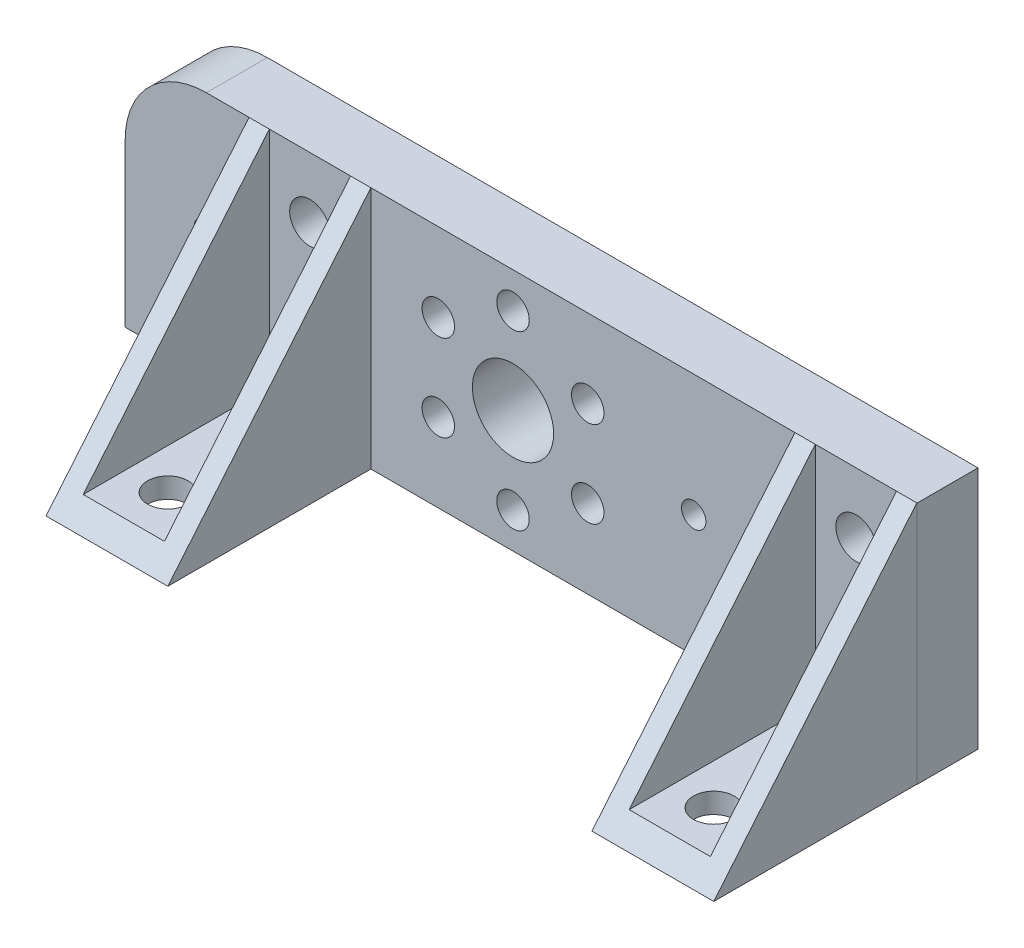
ISO-10303-21;
HEADER;
FILE_DESCRIPTION(('STEP AP214'),'2;1');
FILE_NAME('part.step','',(''),(''),'','','');
FILE_SCHEMA(('AUTOMOTIVE_DESIGN { 1 0 10303 214 1 1 1 1 }'));
ENDSEC;
DATA;
#1=APPLICATION_CONTEXT('core data for automotive mechanical design processes');
#2=APPLICATION_PROTOCOL_DEFINITION('international standard','automotive_design',2000,#1);
#3=PRODUCT_CONTEXT('',#1,'mechanical');
#4=PRODUCT('Part','Part','',(#3));
#5=PRODUCT_RELATED_PRODUCT_CATEGORY('part','',(#4));
#6=PRODUCT_DEFINITION_FORMATION('','',#4);
#7=PRODUCT_DEFINITION_CONTEXT('part definition',#1,'design');
#8=PRODUCT_DEFINITION('design','',#6,#7);
#9=PRODUCT_DEFINITION_SHAPE('','',#8);
#10=(LENGTH_UNIT() NAMED_UNIT(*) SI_UNIT(.MILLI.,.METRE.));
#11=(NAMED_UNIT(*) PLANE_ANGLE_UNIT() SI_UNIT($,.RADIAN.));
#12=(NAMED_UNIT(*) SI_UNIT($,.STERADIAN.) SOLID_ANGLE_UNIT());
#13=UNCERTAINTY_MEASURE_WITH_UNIT(LENGTH_MEASURE(1.E-05),#10,'distance_accuracy_value','');
#14=(GEOMETRIC_REPRESENTATION_CONTEXT(3) GLOBAL_UNCERTAINTY_ASSIGNED_CONTEXT((#13)) GLOBAL_UNIT_ASSIGNED_CONTEXT((#10,
#11,#12)) REPRESENTATION_CONTEXT('',''));
#15=CARTESIAN_POINT('',(0.,0.,0.));
#16=DIRECTION('',(0.,0.,1.));
#17=DIRECTION('',(1.,0.,0.));
#18=AXIS2_PLACEMENT_3D('',#15,#16,#17);
#19=CARTESIAN_POINT('',(0.,0.,3.));
#20=DIRECTION('',(0.,0.,1.));
#21=DIRECTION('',(1.,0.,0.));
#22=AXIS2_PLACEMENT_3D('',#19,#20,#21);
#23=PLANE('',#22);
#24=CARTESIAN_POINT('',(12.9,3.,3.));
#25=DIRECTION('',(0.,0.,1.));
#26=DIRECTION('',(1.,0.,0.));
#27=AXIS2_PLACEMENT_3D('',#24,#25,#26);
#28=CIRCLE('',#27,1.);
#29=CARTESIAN_POINT('',(13.9,3.,3.));
#30=VERTEX_POINT('',#29);
#31=EDGE_CURVE('E393',#30,#30,#28,.T.);
#32=ORIENTED_EDGE('',*,*,#31,.F.);
#33=EDGE_LOOP('',(#32));
#34=FACE_BOUND('',#33,.T.);
#35=CARTESIAN_POINT('',(12.9,-3.,3.));
#36=DIRECTION('',(0.,0.,1.));
#37=DIRECTION('',(1.,0.,0.));
#38=AXIS2_PLACEMENT_3D('',#35,#36,#37);
#39=CIRCLE('',#38,1.);
#40=CARTESIAN_POINT('',(13.9,-3.,3.));
#41=VERTEX_POINT('',#40);
#42=EDGE_CURVE('E390',#41,#41,#39,.T.);
#43=ORIENTED_EDGE('',*,*,#42,.F.);
#44=EDGE_LOOP('',(#43));
#45=FACE_BOUND('',#44,.T.);
#46=DIRECTION('',(1.,0.,0.));
#47=VECTOR('',#46,1.);
#48=CARTESIAN_POINT('',(26.8867571858841,-4.99999999999999,3.));
#49=LINE('',#48,#47);
#50=CARTESIAN_POINT('',(10.8867571858841,-5.,3.));
#51=VERTEX_POINT('',#50);
#52=CARTESIAN_POINT('',(14.8867571858841,-5.,3.));
#53=VERTEX_POINT('',#52);
#54=EDGE_CURVE('E435',#51,#53,#49,.T.);
#55=ORIENTED_EDGE('',*,*,#54,.T.);
#56=DIRECTION('',(0.,-1.,0.));
#57=VECTOR('',#56,1.);
#58=CARTESIAN_POINT('',(14.8867571858841,0.,3.));
#59=LINE('',#58,#57);
#60=CARTESIAN_POINT('',(14.8867571858841,6.,3.));
#61=VERTEX_POINT('',#60);
#62=EDGE_CURVE('E431',#61,#53,#59,.T.);
#63=ORIENTED_EDGE('',*,*,#62,.F.);
#64=DIRECTION('',(1.,0.,0.));
#65=VECTOR('',#64,1.);
#66=CARTESIAN_POINT('',(0.,6.,3.));
#67=LINE('',#66,#65);
#68=CARTESIAN_POINT('',(10.8867571858841,6.,3.));
#69=VERTEX_POINT('',#68);
#70=EDGE_CURVE('E196',#69,#61,#67,.T.);
#71=ORIENTED_EDGE('',*,*,#70,.F.);
#72=DIRECTION('',(0.,-1.,0.));
#73=VECTOR('',#72,1.);
#74=CARTESIAN_POINT('',(10.8867571858841,0.,3.));
#75=LINE('',#74,#73);
#76=EDGE_CURVE('E188',#69,#51,#75,.T.);
#77=ORIENTED_EDGE('',*,*,#76,.T.);
#78=EDGE_LOOP('',(#55,#63,#71,#77));
#79=FACE_BOUND('',#78,.T.);
#80=ADVANCED_FACE('F35',(#34,#45,#79),#23,.T.);
#81=CARTESIAN_POINT('',(15.8867571858841,6.,3.));
#82=VERTEX_POINT('',#81);
#83=CARTESIAN_POINT('',(15.9,6.,3.));
#84=VERTEX_POINT('',#83);
#85=EDGE_CURVE('E199',#82,#84,#67,.T.);
#86=ORIENTED_EDGE('',*,*,#85,.F.);
#87=DIRECTION('',(0.,1.,0.));
#88=VECTOR('',#87,1.);
#89=CARTESIAN_POINT('',(15.8867571858841,0.,3.));
#90=LINE('',#89,#88);
#91=CARTESIAN_POINT('',(15.8867571858841,-6.,3.));
#92=VERTEX_POINT('',#91);
#93=EDGE_CURVE('E187',#92,#82,#90,.T.);
#94=ORIENTED_EDGE('',*,*,#93,.F.);
#95=DIRECTION('',(1.,0.,0.));
#96=VECTOR('',#95,1.);
#97=CARTESIAN_POINT('',(0.,-6.,3.));
#98=LINE('',#97,#96);
#99=CARTESIAN_POINT('',(15.9,-6.,3.));
#100=VERTEX_POINT('',#99);
#101=EDGE_CURVE('E284',#92,#100,#98,.T.);
#102=ORIENTED_EDGE('',*,*,#101,.T.);
#103=DIRECTION('',(0.,1.,0.));
#104=VECTOR('',#103,1.);
#105=CARTESIAN_POINT('',(15.9,0.,3.));
#106=LINE('',#105,#104);
#107=EDGE_CURVE('E204',#100,#84,#106,.T.);
#108=ORIENTED_EDGE('',*,*,#107,.T.);
#109=EDGE_LOOP('',(#86,#94,#102,#108));
#110=FACE_BOUND('',#109,.T.);
#111=ADVANCED_FACE('F290',(#110),#23,.T.);
#112=CARTESIAN_POINT('',(-19.1,0.,3.));
#113=DIRECTION('',(0.,0.,1.));
#114=DIRECTION('',(1.,0.,0.));
#115=AXIS2_PLACEMENT_3D('',#112,#113,#114);
#116=CIRCLE('',#115,0.6);
#117=CARTESIAN_POINT('',(-18.5,0.,3.));
#118=VERTEX_POINT('',#117);
#119=EDGE_CURVE('E396',#118,#118,#116,.T.);
#120=ORIENTED_EDGE('',*,*,#119,.F.);
#121=EDGE_LOOP('',(#120));
#122=FACE_BOUND('',#121,.T.);
#123=CARTESIAN_POINT('',(-23.1,-6.,3.));
#124=VERTEX_POINT('',#123);
#125=CARTESIAN_POINT('',(-17.,-6.,3.));
#126=VERTEX_POINT('',#125);
#127=EDGE_CURVE('E261',#124,#126,#98,.T.);
#128=ORIENTED_EDGE('',*,*,#127,.T.);
#129=DIRECTION('',(0.,1.,0.));
#130=VECTOR('',#129,1.);
#131=CARTESIAN_POINT('',(-17.,0.,3.));
#132=LINE('',#131,#130);
#133=CARTESIAN_POINT('',(-17.,6.,3.));
#134=VERTEX_POINT('',#133);
#135=EDGE_CURVE('E340',#126,#134,#132,.T.);
#136=ORIENTED_EDGE('',*,*,#135,.T.);
#137=CARTESIAN_POINT('',(-19.1,6.,3.));
#138=VERTEX_POINT('',#137);
#139=EDGE_CURVE('E198',#138,#134,#67,.T.);
#140=ORIENTED_EDGE('',*,*,#139,.F.);
#141=CARTESIAN_POINT('',(-19.1,2.,3.));
#142=DIRECTION('',(0.,0.,1.));
#143=DIRECTION('',(1.,0.,0.));
#144=AXIS2_PLACEMENT_3D('',#141,#142,#143);
#145=CIRCLE('',#144,4.);
#146=CARTESIAN_POINT('',(-23.1,2.,3.));
#147=VERTEX_POINT('',#146);
#148=EDGE_CURVE('E286',#147,#138,#145,.F.);
#149=ORIENTED_EDGE('',*,*,#148,.F.);
#150=DIRECTION('',(0.,1.,0.));
#151=VECTOR('',#150,1.);
#152=CARTESIAN_POINT('',(-23.1,0.,3.));
#153=LINE('',#152,#151);
#154=EDGE_CURVE('E271',#124,#147,#153,.T.);
#155=ORIENTED_EDGE('',*,*,#154,.F.);
#156=EDGE_LOOP('',(#128,#136,#140,#149,#155));
#157=FACE_BOUND('',#156,.T.);
#158=ADVANCED_FACE('F400',(#122,#157),#23,.T.);
#159=CARTESIAN_POINT('',(-14.,-3.,3.));
#160=DIRECTION('',(0.,0.,1.));
#161=DIRECTION('',(1.,0.,0.));
#162=AXIS2_PLACEMENT_3D('',#159,#160,#161);
#163=CIRCLE('',#162,1.);
#164=CARTESIAN_POINT('',(-13.,-3.,3.));
#165=VERTEX_POINT('',#164);
#166=EDGE_CURVE('E387',#165,#165,#163,.T.);
#167=ORIENTED_EDGE('',*,*,#166,.F.);
#168=EDGE_LOOP('',(#167));
#169=FACE_BOUND('',#168,.T.);
#170=CARTESIAN_POINT('',(-14.,3.,3.));
#171=DIRECTION('',(0.,0.,1.));
#172=DIRECTION('',(1.,0.,0.));
#173=AXIS2_PLACEMENT_3D('',#170,#171,#172);
#174=CIRCLE('',#173,1.);
#175=CARTESIAN_POINT('',(-13.,3.,3.));
#176=VERTEX_POINT('',#175);
#177=EDGE_CURVE('E249',#176,#176,#174,.T.);
#178=ORIENTED_EDGE('',*,*,#177,.F.);
#179=EDGE_LOOP('',(#178));
#180=FACE_BOUND('',#179,.T.);
#181=CARTESIAN_POINT('',(-16.,6.,3.));
#182=VERTEX_POINT('',#181);
#183=CARTESIAN_POINT('',(-12.,6.,3.));
#184=VERTEX_POINT('',#183);
#185=EDGE_CURVE('E195',#182,#184,#67,.T.);
#186=ORIENTED_EDGE('',*,*,#185,.F.);
#187=DIRECTION('',(0.,-1.,0.));
#188=VECTOR('',#187,1.);
#189=CARTESIAN_POINT('',(-16.,0.,3.));
#190=LINE('',#189,#188);
#191=CARTESIAN_POINT('',(-16.,-5.,3.));
#192=VERTEX_POINT('',#191);
#193=EDGE_CURVE('E338',#182,#192,#190,.T.);
#194=ORIENTED_EDGE('',*,*,#193,.T.);
#195=DIRECTION('',(1.,0.,0.));
#196=VECTOR('',#195,1.);
#197=CARTESIAN_POINT('',(0.,-4.99999999999999,3.));
#198=LINE('',#197,#196);
#199=CARTESIAN_POINT('',(-12.,-5.,3.));
#200=VERTEX_POINT('',#199);
#201=EDGE_CURVE('E335',#192,#200,#198,.T.);
#202=ORIENTED_EDGE('',*,*,#201,.T.);
#203=DIRECTION('',(0.,-1.,0.));
#204=VECTOR('',#203,1.);
#205=CARTESIAN_POINT('',(-12.,0.,3.));
#206=LINE('',#205,#204);
#207=EDGE_CURVE('E328',#184,#200,#206,.T.);
#208=ORIENTED_EDGE('',*,*,#207,.F.);
#209=EDGE_LOOP('',(#186,#194,#202,#208));
#210=FACE_BOUND('',#209,.T.);
#211=ADVANCED_FACE('F408',(#169,#180,#210),#23,.T.);
#212=CARTESIAN_POINT('',(-19.1,2.,3.));
#213=DIRECTION('',(0.,0.,-1.));
#214=DIRECTION('',(-1.,0.,0.));
#215=AXIS2_PLACEMENT_3D('',#212,#213,#214);
#216=CYLINDRICAL_SURFACE('',#215,4.);
#217=CARTESIAN_POINT('',(-19.1,2.,0.));
#218=DIRECTION('',(0.,0.,1.));
#219=DIRECTION('',(1.,0.,0.));
#220=AXIS2_PLACEMENT_3D('',#217,#218,#219);
#221=CIRCLE('',#220,4.);
#222=CARTESIAN_POINT('',(-23.1,2.,0.));
#223=VERTEX_POINT('',#222);
#224=CARTESIAN_POINT('',(-19.1,6.,0.));
#225=VERTEX_POINT('',#224);
#226=EDGE_CURVE('E228',#223,#225,#221,.F.);
#227=ORIENTED_EDGE('',*,*,#226,.F.);
#228=DIRECTION('',(0.,0.,-1.));
#229=VECTOR('',#228,1.);
#230=CARTESIAN_POINT('',(-23.1,2.,3.));
#231=LINE('',#230,#229);
#232=EDGE_CURVE('E11',#147,#223,#231,.T.);
#233=ORIENTED_EDGE('',*,*,#232,.F.);
#234=ORIENTED_EDGE('',*,*,#148,.T.);
#235=DIRECTION('',(0.,0.,-1.));
#236=VECTOR('',#235,1.);
#237=CARTESIAN_POINT('',(-19.1,6.,3.));
#238=LINE('',#237,#236);
#239=EDGE_CURVE('E211',#138,#225,#238,.T.);
#240=ORIENTED_EDGE('',*,*,#239,.T.);
#241=EDGE_LOOP('',(#227,#233,#234,#240));
#242=FACE_BOUND('',#241,.T.);
#243=ADVANCED_FACE('F275',(#242),#216,.T.);
#244=CARTESIAN_POINT('',(-23.1,0.,3.));
#245=DIRECTION('',(-1.,0.,0.));
#246=DIRECTION('',(0.,0.,1.));
#247=AXIS2_PLACEMENT_3D('',#244,#245,#246);
#248=PLANE('',#247);
#249=DIRECTION('',(0.,1.,0.));
#250=VECTOR('',#249,1.);
#251=CARTESIAN_POINT('',(-23.1,0.,0.));
#252=LINE('',#251,#250);
#253=CARTESIAN_POINT('',(-23.1,-6.,0.));
#254=VERTEX_POINT('',#253);
#255=EDGE_CURVE('E231',#254,#223,#252,.T.);
#256=ORIENTED_EDGE('',*,*,#255,.F.);
#257=DIRECTION('',(0.,0.,-1.));
#258=VECTOR('',#257,1.);
#259=CARTESIAN_POINT('',(-23.1,-6.,3.));
#260=LINE('',#259,#258);
#261=EDGE_CURVE('E43',#124,#254,#260,.T.);
#262=ORIENTED_EDGE('',*,*,#261,.F.);
#263=ORIENTED_EDGE('',*,*,#154,.T.);
#264=ORIENTED_EDGE('',*,*,#232,.T.);
#265=EDGE_LOOP('',(#256,#262,#263,#264));
#266=FACE_BOUND('',#265,.T.);
#267=ADVANCED_FACE('F269',(#266),#248,.T.);
#268=CARTESIAN_POINT('',(0.,-6.,3.));
#269=DIRECTION('',(0.,1.,0.));
#270=DIRECTION('',(0.,0.,1.));
#271=AXIS2_PLACEMENT_3D('',#268,#269,#270);
#272=PLANE('',#271);
#273=CARTESIAN_POINT('',(12.8867571858841,-6.,5.));
#274=DIRECTION('',(0.,1.,0.));
#275=DIRECTION('',(0.,0.,1.));
#276=AXIS2_PLACEMENT_3D('',#273,#274,#275);
#277=CIRCLE('',#276,1.);
#278=CARTESIAN_POINT('',(12.8867571858841,-6.,6.));
#279=VERTEX_POINT('',#278);
#280=EDGE_CURVE('E177',#279,#279,#277,.T.);
#281=ORIENTED_EDGE('',*,*,#280,.T.);
#282=EDGE_LOOP('',(#281));
#283=FACE_BOUND('',#282,.T.);
#284=CARTESIAN_POINT('',(12.8867571858841,-6.,10.));
#285=DIRECTION('',(0.,1.,0.));
#286=DIRECTION('',(0.,0.,1.));
#287=AXIS2_PLACEMENT_3D('',#284,#285,#286);
#288=CIRCLE('',#287,1.);
#289=CARTESIAN_POINT('',(12.8867571858841,-6.,11.));
#290=VERTEX_POINT('',#289);
#291=EDGE_CURVE('E790',#290,#290,#288,.T.);
#292=ORIENTED_EDGE('',*,*,#291,.T.);
#293=EDGE_LOOP('',(#292));
#294=FACE_BOUND('',#293,.T.);
#295=CARTESIAN_POINT('',(-14.,-6.,5.));
#296=DIRECTION('',(0.,1.,0.));
#297=DIRECTION('',(0.,0.,1.));
#298=AXIS2_PLACEMENT_3D('',#295,#296,#297);
#299=CIRCLE('',#298,1.);
#300=CARTESIAN_POINT('',(-14.,-6.,6.));
#301=VERTEX_POINT('',#300);
#302=EDGE_CURVE('E311',#301,#301,#299,.T.);
#303=ORIENTED_EDGE('',*,*,#302,.T.);
#304=EDGE_LOOP('',(#303));
#305=FACE_BOUND('',#304,.T.);
#306=CARTESIAN_POINT('',(-14.,-6.,10.));
#307=DIRECTION('',(0.,1.,0.));
#308=DIRECTION('',(0.,0.,1.));
#309=AXIS2_PLACEMENT_3D('',#306,#307,#308);
#310=CIRCLE('',#309,1.);
#311=CARTESIAN_POINT('',(-14.,-6.,11.));
#312=VERTEX_POINT('',#311);
#313=EDGE_CURVE('E306',#312,#312,#310,.T.);
#314=ORIENTED_EDGE('',*,*,#313,.T.);
#315=EDGE_LOOP('',(#314));
#316=FACE_BOUND('',#315,.T.);
#317=DIRECTION('',(1.,0.,0.));
#318=VECTOR('',#317,1.);
#319=CARTESIAN_POINT('',(0.,-6.,0.));
#320=LINE('',#319,#318);
#321=CARTESIAN_POINT('',(15.9,-6.,0.));
#322=VERTEX_POINT('',#321);
#323=EDGE_CURVE('E234',#254,#322,#320,.T.);
#324=ORIENTED_EDGE('',*,*,#323,.T.);
#325=DIRECTION('',(0.,0.,-1.));
#326=VECTOR('',#325,1.);
#327=CARTESIAN_POINT('',(15.9,-6.,3.));
#328=LINE('',#327,#326);
#329=EDGE_CURVE('E253',#100,#322,#328,.T.);
#330=ORIENTED_EDGE('',*,*,#329,.F.);
#331=ORIENTED_EDGE('',*,*,#101,.F.);
#332=DIRECTION('',(0.,0.,-1.));
#333=VECTOR('',#332,1.);
#334=CARTESIAN_POINT('',(15.8867571858841,-6.,13.));
#335=LINE('',#334,#333);
#336=CARTESIAN_POINT('',(15.8867571858841,-6.,13.));
#337=VERTEX_POINT('',#336);
#338=EDGE_CURVE('E50',#337,#92,#335,.T.);
#339=ORIENTED_EDGE('',*,*,#338,.F.);
#340=DIRECTION('',(1.,0.,0.));
#341=VECTOR('',#340,1.);
#342=CARTESIAN_POINT('',(26.8867571858841,-6.,13.));
#343=LINE('',#342,#341);
#344=CARTESIAN_POINT('',(9.88675718588411,-6.,13.));
#345=VERTEX_POINT('',#344);
#346=EDGE_CURVE('E291',#345,#337,#343,.T.);
#347=ORIENTED_EDGE('',*,*,#346,.F.);
#348=DIRECTION('',(0.,0.,-1.));
#349=VECTOR('',#348,1.);
#350=CARTESIAN_POINT('',(9.88675718588411,-6.,13.));
#351=LINE('',#350,#349);
#352=CARTESIAN_POINT('',(9.88675718588411,-6.,3.));
#353=VERTEX_POINT('',#352);
#354=EDGE_CURVE('E175',#345,#353,#351,.T.);
#355=ORIENTED_EDGE('',*,*,#354,.T.);
#356=CARTESIAN_POINT('',(-11.,-6.,3.));
#357=VERTEX_POINT('',#356);
#358=EDGE_CURVE('E186',#357,#353,#98,.T.);
#359=ORIENTED_EDGE('',*,*,#358,.F.);
#360=DIRECTION('',(0.,0.,-1.));
#361=VECTOR('',#360,1.);
#362=CARTESIAN_POINT('',(-11.,-6.,13.));
#363=LINE('',#362,#361);
#364=CARTESIAN_POINT('',(-11.,-6.,13.));
#365=VERTEX_POINT('',#364);
#366=EDGE_CURVE('E331',#365,#357,#363,.T.);
#367=ORIENTED_EDGE('',*,*,#366,.F.);
#368=DIRECTION('',(1.,0.,0.));
#369=VECTOR('',#368,1.);
#370=CARTESIAN_POINT('',(0.,-6.,13.));
#371=LINE('',#370,#369);
#372=CARTESIAN_POINT('',(-17.,-6.,13.));
#373=VERTEX_POINT('',#372);
#374=EDGE_CURVE('E329',#373,#365,#371,.T.);
#375=ORIENTED_EDGE('',*,*,#374,.F.);
#376=DIRECTION('',(0.,0.,-1.));
#377=VECTOR('',#376,1.);
#378=CARTESIAN_POINT('',(-17.,-6.,13.));
#379=LINE('',#378,#377);
#380=EDGE_CURVE('E345',#373,#126,#379,.T.);
#381=ORIENTED_EDGE('',*,*,#380,.T.);
#382=ORIENTED_EDGE('',*,*,#127,.F.);
#383=ORIENTED_EDGE('',*,*,#261,.T.);
#384=EDGE_LOOP('',(#324,#330,#331,#339,#347,#355,#359,#367,#375,#381,#382,#383));
#385=FACE_BOUND('',#384,.T.);
#386=ADVANCED_FACE('F258',(#283,#294,#305,#316,#385),#272,.F.);
#387=CARTESIAN_POINT('',(15.9,0.,3.));
#388=DIRECTION('',(-1.,0.,0.));
#389=DIRECTION('',(0.,-1.,0.));
#390=AXIS2_PLACEMENT_3D('',#387,#388,#389);
#391=PLANE('',#390);
#392=DIRECTION('',(0.,1.,0.));
#393=VECTOR('',#392,1.);
#394=CARTESIAN_POINT('',(15.9,0.,0.));
#395=LINE('',#394,#393);
#396=CARTESIAN_POINT('',(15.9,6.,0.));
#397=VERTEX_POINT('',#396);
#398=EDGE_CURVE('E237',#322,#397,#395,.T.);
#399=ORIENTED_EDGE('',*,*,#398,.T.);
#400=DIRECTION('',(0.,0.,-1.));
#401=VECTOR('',#400,1.);
#402=CARTESIAN_POINT('',(15.9,6.,3.));
#403=LINE('',#402,#401);
#404=EDGE_CURVE('E251',#84,#397,#403,.T.);
#405=ORIENTED_EDGE('',*,*,#404,.F.);
#406=ORIENTED_EDGE('',*,*,#107,.F.);
#407=ORIENTED_EDGE('',*,*,#329,.T.);
#408=EDGE_LOOP('',(#399,#405,#406,#407));
#409=FACE_BOUND('',#408,.T.);
#410=ADVANCED_FACE('F282',(#409),#391,.F.);
#411=CARTESIAN_POINT('',(4.9,0.,3.));
#412=DIRECTION('',(0.,0.,-1.));
#413=DIRECTION('',(-1.,0.,0.));
#414=AXIS2_PLACEMENT_3D('',#411,#412,#413);
#415=CYLINDRICAL_SURFACE('',#414,0.6);
#416=CARTESIAN_POINT('',(4.9,0.,3.));
#417=DIRECTION('',(0.,0.,1.));
#418=DIRECTION('',(1.,0.,0.));
#419=AXIS2_PLACEMENT_3D('',#416,#417,#418);
#420=CIRCLE('',#419,0.6);
#421=CARTESIAN_POINT('',(5.5,0.,3.));
#422=VERTEX_POINT('',#421);
#423=EDGE_CURVE('E203',#422,#422,#420,.T.);
#424=ORIENTED_EDGE('',*,*,#423,.T.);
#425=EDGE_LOOP('',(#424));
#426=FACE_BOUND('',#425,.T.);
#427=CARTESIAN_POINT('',(4.9,0.,0.));
#428=DIRECTION('',(0.,0.,1.));
#429=DIRECTION('',(1.,0.,0.));
#430=AXIS2_PLACEMENT_3D('',#427,#428,#429);
#431=CIRCLE('',#430,0.6);
#432=CARTESIAN_POINT('',(5.5,0.,0.));
#433=VERTEX_POINT('',#432);
#434=EDGE_CURVE('E243',#433,#433,#431,.T.);
#435=ORIENTED_EDGE('',*,*,#434,.F.);
#436=EDGE_LOOP('',(#435));
#437=FACE_BOUND('',#436,.T.);
#438=ADVANCED_FACE('F521',(#426,#437),#415,.F.);
#439=CARTESIAN_POINT('',(0.,6.,3.));
#440=DIRECTION('',(0.,1.,0.));
#441=DIRECTION('',(0.,0.,1.));
#442=AXIS2_PLACEMENT_3D('',#439,#440,#441);
#443=PLANE('',#442);
#444=DIRECTION('',(-1.,0.,0.));
#445=VECTOR('',#444,1.);
#446=CARTESIAN_POINT('',(54.8867571858841,6.,3.));
#447=LINE('',#446,#445);
#448=EDGE_CURVE('E167',#82,#61,#447,.T.);
#449=ORIENTED_EDGE('',*,*,#448,.F.);
#450=ORIENTED_EDGE('',*,*,#85,.T.);
#451=ORIENTED_EDGE('',*,*,#404,.T.);
#452=DIRECTION('',(1.,0.,0.));
#453=VECTOR('',#452,1.);
#454=CARTESIAN_POINT('',(0.,6.,0.));
#455=LINE('',#454,#453);
#456=EDGE_CURVE('E240',#225,#397,#455,.T.);
#457=ORIENTED_EDGE('',*,*,#456,.F.);
#458=ORIENTED_EDGE('',*,*,#239,.F.);
#459=ORIENTED_EDGE('',*,*,#139,.T.);
#460=DIRECTION('',(-1.,0.,0.));
#461=VECTOR('',#460,1.);
#462=CARTESIAN_POINT('',(28.,6.,3.));
#463=LINE('',#462,#461);
#464=EDGE_CURVE('E316',#182,#134,#463,.T.);
#465=ORIENTED_EDGE('',*,*,#464,.F.);
#466=ORIENTED_EDGE('',*,*,#185,.T.);
#467=CARTESIAN_POINT('',(-11.,6.,3.));
#468=VERTEX_POINT('',#467);
#469=EDGE_CURVE('E194',#468,#184,#463,.T.);
#470=ORIENTED_EDGE('',*,*,#469,.F.);
#471=CARTESIAN_POINT('',(9.88675718588411,6.,3.));
#472=VERTEX_POINT('',#471);
#473=EDGE_CURVE('E183',#468,#472,#67,.T.);
#474=ORIENTED_EDGE('',*,*,#473,.T.);
#475=EDGE_CURVE('E156',#69,#472,#447,.T.);
#476=ORIENTED_EDGE('',*,*,#475,.F.);
#477=ORIENTED_EDGE('',*,*,#70,.T.);
#478=EDGE_LOOP('',(#449,#450,#451,#457,#458,#459,#465,#466,#470,#474,#476,#477));
#479=FACE_BOUND('',#478,.T.);
#480=ADVANCED_FACE('F192',(#479),#443,.T.);
#481=CARTESIAN_POINT('',(-19.1,0.,3.));
#482=DIRECTION('',(0.,0.,-1.));
#483=DIRECTION('',(-1.,0.,0.));
#484=AXIS2_PLACEMENT_3D('',#481,#482,#483);
#485=CYLINDRICAL_SURFACE('',#484,0.6);
#486=ORIENTED_EDGE('',*,*,#119,.T.);
#487=EDGE_LOOP('',(#486));
#488=FACE_BOUND('',#487,.T.);
#489=CARTESIAN_POINT('',(-19.1,0.,0.));
#490=DIRECTION('',(0.,0.,1.));
#491=DIRECTION('',(1.,0.,0.));
#492=AXIS2_PLACEMENT_3D('',#489,#490,#491);
#493=CIRCLE('',#492,0.6);
#494=CARTESIAN_POINT('',(-18.5,0.,0.));
#495=VERTEX_POINT('',#494);
#496=EDGE_CURVE('E225',#495,#495,#493,.T.);
#497=ORIENTED_EDGE('',*,*,#496,.F.);
#498=EDGE_LOOP('',(#497));
#499=FACE_BOUND('',#498,.T.);
#500=ADVANCED_FACE('F509',(#488,#499),#485,.F.);
#501=CARTESIAN_POINT('',(12.9,3.,3.));
#502=DIRECTION('',(0.,0.,-1.));
#503=DIRECTION('',(-1.,0.,0.));
#504=AXIS2_PLACEMENT_3D('',#501,#502,#503);
#505=CYLINDRICAL_SURFACE('',#504,1.);
#506=ORIENTED_EDGE('',*,*,#31,.T.);
#507=EDGE_LOOP('',(#506));
#508=FACE_BOUND('',#507,.T.);
#509=CARTESIAN_POINT('',(12.9,3.,0.));
#510=DIRECTION('',(0.,0.,1.));
#511=DIRECTION('',(1.,0.,0.));
#512=AXIS2_PLACEMENT_3D('',#509,#510,#511);
#513=CIRCLE('',#512,1.);
#514=CARTESIAN_POINT('',(13.9,3.,0.));
#515=VERTEX_POINT('',#514);
#516=EDGE_CURVE('E222',#515,#515,#513,.T.);
#517=ORIENTED_EDGE('',*,*,#516,.F.);
#518=EDGE_LOOP('',(#517));
#519=FACE_BOUND('',#518,.T.);
#520=ADVANCED_FACE('F511',(#508,#519),#505,.F.);
#521=CARTESIAN_POINT('',(12.9,-3.,3.));
#522=DIRECTION('',(0.,0.,-1.));
#523=DIRECTION('',(-1.,0.,0.));
#524=AXIS2_PLACEMENT_3D('',#521,#522,#523);
#525=CYLINDRICAL_SURFACE('',#524,1.);
#526=ORIENTED_EDGE('',*,*,#42,.T.);
#527=EDGE_LOOP('',(#526));
#528=FACE_BOUND('',#527,.T.);
#529=CARTESIAN_POINT('',(12.9,-3.,0.));
#530=DIRECTION('',(0.,0.,1.));
#531=DIRECTION('',(1.,0.,0.));
#532=AXIS2_PLACEMENT_3D('',#529,#530,#531);
#533=CIRCLE('',#532,1.);
#534=CARTESIAN_POINT('',(13.9,-3.,0.));
#535=VERTEX_POINT('',#534);
#536=EDGE_CURVE('E219',#535,#535,#533,.T.);
#537=ORIENTED_EDGE('',*,*,#536,.F.);
#538=EDGE_LOOP('',(#537));
#539=FACE_BOUND('',#538,.T.);
#540=ADVANCED_FACE('F518',(#528,#539),#525,.F.);
#541=CARTESIAN_POINT('',(-14.,-3.,3.));
#542=DIRECTION('',(0.,0.,-1.));
#543=DIRECTION('',(-1.,0.,0.));
#544=AXIS2_PLACEMENT_3D('',#541,#542,#543);
#545=CYLINDRICAL_SURFACE('',#544,1.);
#546=ORIENTED_EDGE('',*,*,#166,.T.);
#547=EDGE_LOOP('',(#546));
#548=FACE_BOUND('',#547,.T.);
#549=CARTESIAN_POINT('',(-14.,-3.,0.));
#550=DIRECTION('',(0.,0.,1.));
#551=DIRECTION('',(1.,0.,0.));
#552=AXIS2_PLACEMENT_3D('',#549,#550,#551);
#553=CIRCLE('',#552,1.);
#554=CARTESIAN_POINT('',(-13.,-3.,0.));
#555=VERTEX_POINT('',#554);
#556=EDGE_CURVE('E215',#555,#555,#553,.T.);
#557=ORIENTED_EDGE('',*,*,#556,.F.);
#558=EDGE_LOOP('',(#557));
#559=FACE_BOUND('',#558,.T.);
#560=ADVANCED_FACE('F497',(#548,#559),#545,.F.);
#561=CARTESIAN_POINT('',(-14.,3.,3.));
#562=DIRECTION('',(0.,0.,-1.));
#563=DIRECTION('',(-1.,0.,0.));
#564=AXIS2_PLACEMENT_3D('',#561,#562,#563);
#565=CYLINDRICAL_SURFACE('',#564,1.);
#566=ORIENTED_EDGE('',*,*,#177,.T.);
#567=EDGE_LOOP('',(#566));
#568=FACE_BOUND('',#567,.T.);
#569=CARTESIAN_POINT('',(-14.,3.,0.));
#570=DIRECTION('',(0.,0.,1.));
#571=DIRECTION('',(1.,0.,0.));
#572=AXIS2_PLACEMENT_3D('',#569,#570,#571);
#573=CIRCLE('',#572,1.);
#574=CARTESIAN_POINT('',(-13.,3.,0.));
#575=VERTEX_POINT('',#574);
#576=EDGE_CURVE('E212',#575,#575,#573,.T.);
#577=ORIENTED_EDGE('',*,*,#576,.F.);
#578=EDGE_LOOP('',(#577));
#579=FACE_BOUND('',#578,.T.);
#580=ADVANCED_FACE('F37',(#568,#579),#565,.F.);
#581=CARTESIAN_POINT('',(-4.,0.,3.));
#582=DIRECTION('',(0.,0.,-1.));
#583=DIRECTION('',(-1.,0.,0.));
#584=AXIS2_PLACEMENT_3D('',#581,#582,#583);
#585=CYLINDRICAL_SURFACE('',#584,2.);
#586=CARTESIAN_POINT('',(-4.,0.,3.));
#587=DIRECTION('',(0.,0.,1.));
#588=DIRECTION('',(1.,0.,0.));
#589=AXIS2_PLACEMENT_3D('',#586,#587,#588);
#590=CIRCLE('',#589,2.);
#591=CARTESIAN_POINT('',(-2.,0.,3.));
#592=VERTEX_POINT('',#591);
#593=EDGE_CURVE('E208',#592,#592,#590,.T.);
#594=ORIENTED_EDGE('',*,*,#593,.T.);
#595=EDGE_LOOP('',(#594));
#596=FACE_BOUND('',#595,.T.);
#597=CARTESIAN_POINT('',(-4.,0.,0.));
#598=DIRECTION('',(0.,0.,1.));
#599=DIRECTION('',(1.,0.,0.));
#600=AXIS2_PLACEMENT_3D('',#597,#598,#599);
#601=CIRCLE('',#600,2.);
#602=CARTESIAN_POINT('',(-2.,0.,0.));
#603=VERTEX_POINT('',#602);
#604=EDGE_CURVE('E246',#603,#603,#601,.T.);
#605=ORIENTED_EDGE('',*,*,#604,.F.);
#606=EDGE_LOOP('',(#605));
#607=FACE_BOUND('',#606,.T.);
#608=ADVANCED_FACE('F474',(#596,#607),#585,.F.);
#609=DIRECTION('',(0.,1.,0.));
#610=VECTOR('',#609,1.);
#611=CARTESIAN_POINT('',(9.88675718588411,0.,3.));
#612=LINE('',#611,#610);
#613=EDGE_CURVE('E173',#353,#472,#612,.T.);
#614=ORIENTED_EDGE('',*,*,#613,.T.);
#615=ORIENTED_EDGE('',*,*,#473,.F.);
#616=DIRECTION('',(0.,1.,0.));
#617=VECTOR('',#616,1.);
#618=CARTESIAN_POINT('',(-11.,0.,3.));
#619=LINE('',#618,#617);
#620=EDGE_CURVE('E332',#357,#468,#619,.T.);
#621=ORIENTED_EDGE('',*,*,#620,.F.);
#622=ORIENTED_EDGE('',*,*,#358,.T.);
#623=EDGE_LOOP('',(#614,#615,#621,#622));
#624=FACE_BOUND('',#623,.T.);
#625=CARTESIAN_POINT('',(-0.31939203391616,2.12500000000004,3.));
#626=DIRECTION('',(0.,0.,1.));
#627=DIRECTION('',(0.50000000000001,-0.866025403784433,0.));
#628=AXIS2_PLACEMENT_3D('',#625,#626,#627);
#629=CIRCLE('',#628,0.8);
#630=CARTESIAN_POINT('',(0.0806079660838479,1.4321796769725,3.));
#631=VERTEX_POINT('',#630);
#632=EDGE_CURVE('E350',#631,#631,#629,.T.);
#633=ORIENTED_EDGE('',*,*,#632,.F.);
#634=EDGE_LOOP('',(#633));
#635=FACE_BOUND('',#634,.T.);
#636=CARTESIAN_POINT('',(-0.319392033916116,-2.12499999999997,3.));
#637=DIRECTION('',(0.,0.,1.));
#638=DIRECTION('',(-0.499999999999992,-0.866025403784443,0.));
#639=AXIS2_PLACEMENT_3D('',#636,#637,#638);
#640=CIRCLE('',#639,0.8);
#641=CARTESIAN_POINT('',(-0.719392033916109,-2.81782032302752,3.));
#642=VERTEX_POINT('',#641);
#643=EDGE_CURVE('E367',#642,#642,#640,.T.);
#644=ORIENTED_EDGE('',*,*,#643,.F.);
#645=EDGE_LOOP('',(#644));
#646=FACE_BOUND('',#645,.T.);
#647=CARTESIAN_POINT('',(-4.,-4.25,3.));
#648=DIRECTION('',(0.,0.,1.));
#649=DIRECTION('',(-1.,0.,0.));
#650=AXIS2_PLACEMENT_3D('',#647,#648,#649);
#651=CIRCLE('',#650,0.8);
#652=CARTESIAN_POINT('',(-4.8,-4.25,3.));
#653=VERTEX_POINT('',#652);
#654=EDGE_CURVE('E361',#653,#653,#651,.T.);
#655=ORIENTED_EDGE('',*,*,#654,.F.);
#656=EDGE_LOOP('',(#655));
#657=FACE_BOUND('',#656,.T.);
#658=CARTESIAN_POINT('',(-7.68060796608386,-2.12500000000002,3.));
#659=DIRECTION('',(0.,0.,1.));
#660=DIRECTION('',(-0.500000000000004,0.866025403784436,0.));
#661=AXIS2_PLACEMENT_3D('',#658,#659,#660);
#662=CIRCLE('',#661,0.8);
#663=CARTESIAN_POINT('',(-8.08060796608386,-1.43217967697247,3.));
#664=VERTEX_POINT('',#663);
#665=EDGE_CURVE('E355',#664,#664,#662,.T.);
#666=ORIENTED_EDGE('',*,*,#665,.F.);
#667=EDGE_LOOP('',(#666));
#668=FACE_BOUND('',#667,.T.);
#669=CARTESIAN_POINT('',(-7.68060796608387,2.12499999999999,3.));
#670=DIRECTION('',(0.,0.,1.));
#671=DIRECTION('',(0.499999999999998,0.86602540378444,0.));
#672=AXIS2_PLACEMENT_3D('',#669,#670,#671);
#673=CIRCLE('',#672,0.8);
#674=CARTESIAN_POINT('',(-7.28060796608387,2.81782032302754,3.));
#675=VERTEX_POINT('',#674);
#676=EDGE_CURVE('E354',#675,#675,#673,.T.);
#677=ORIENTED_EDGE('',*,*,#676,.F.);
#678=EDGE_LOOP('',(#677));
#679=FACE_BOUND('',#678,.T.);
#680=CARTESIAN_POINT('',(-4.,4.25,3.));
#681=DIRECTION('',(0.,0.,1.));
#682=DIRECTION('',(1.,0.,0.));
#683=AXIS2_PLACEMENT_3D('',#680,#681,#682);
#684=CIRCLE('',#683,0.8);
#685=CARTESIAN_POINT('',(-3.2,4.25,3.));
#686=VERTEX_POINT('',#685);
#687=EDGE_CURVE('E378',#686,#686,#684,.T.);
#688=ORIENTED_EDGE('',*,*,#687,.F.);
#689=EDGE_LOOP('',(#688));
#690=FACE_BOUND('',#689,.T.);
#691=ORIENTED_EDGE('',*,*,#423,.F.);
#692=EDGE_LOOP('',(#691));
#693=FACE_BOUND('',#692,.T.);
#694=ORIENTED_EDGE('',*,*,#593,.F.);
#695=EDGE_LOOP('',(#694));
#696=FACE_BOUND('',#695,.T.);
#697=ADVANCED_FACE('F181',(#624,#635,#646,#657,#668,#679,#690,#693,#696),#23,.T.);
#698=CARTESIAN_POINT('',(0.,0.,0.));
#699=DIRECTION('',(0.,0.,1.));
#700=DIRECTION('',(1.,0.,0.));
#701=AXIS2_PLACEMENT_3D('',#698,#699,#700);
#702=PLANE('',#701);
#703=CARTESIAN_POINT('',(-0.31939203391616,2.12500000000004,0.));
#704=DIRECTION('',(0.,0.,1.));
#705=DIRECTION('',(0.50000000000001,-0.866025403784433,0.));
#706=AXIS2_PLACEMENT_3D('',#703,#704,#705);
#707=CIRCLE('',#706,0.8);
#708=CARTESIAN_POINT('',(0.0806079660838479,1.4321796769725,0.));
#709=VERTEX_POINT('',#708);
#710=EDGE_CURVE('E370',#709,#709,#707,.T.);
#711=ORIENTED_EDGE('',*,*,#710,.T.);
#712=EDGE_LOOP('',(#711));
#713=FACE_BOUND('',#712,.T.);
#714=CARTESIAN_POINT('',(-0.319392033916116,-2.12499999999997,0.));
#715=DIRECTION('',(0.,0.,1.));
#716=DIRECTION('',(-0.499999999999992,-0.866025403784443,0.));
#717=AXIS2_PLACEMENT_3D('',#714,#715,#716);
#718=CIRCLE('',#717,0.8);
#719=CARTESIAN_POINT('',(-0.719392033916109,-2.81782032302752,0.));
#720=VERTEX_POINT('',#719);
#721=EDGE_CURVE('E364',#720,#720,#718,.T.);
#722=ORIENTED_EDGE('',*,*,#721,.T.);
#723=EDGE_LOOP('',(#722));
#724=FACE_BOUND('',#723,.T.);
#725=CARTESIAN_POINT('',(-4.,-4.25,0.));
#726=DIRECTION('',(0.,0.,1.));
#727=DIRECTION('',(-1.,0.,0.));
#728=AXIS2_PLACEMENT_3D('',#725,#726,#727);
#729=CIRCLE('',#728,0.8);
#730=CARTESIAN_POINT('',(-4.8,-4.25,0.));
#731=VERTEX_POINT('',#730);
#732=EDGE_CURVE('E358',#731,#731,#729,.T.);
#733=ORIENTED_EDGE('',*,*,#732,.T.);
#734=EDGE_LOOP('',(#733));
#735=FACE_BOUND('',#734,.T.);
#736=CARTESIAN_POINT('',(-7.68060796608386,-2.12500000000002,0.));
#737=DIRECTION('',(0.,0.,1.));
#738=DIRECTION('',(-0.500000000000004,0.866025403784436,0.));
#739=AXIS2_PLACEMENT_3D('',#736,#737,#738);
#740=CIRCLE('',#739,0.8);
#741=CARTESIAN_POINT('',(-8.08060796608386,-1.43217967697247,0.));
#742=VERTEX_POINT('',#741);
#743=EDGE_CURVE('E351',#742,#742,#740,.T.);
#744=ORIENTED_EDGE('',*,*,#743,.T.);
#745=EDGE_LOOP('',(#744));
#746=FACE_BOUND('',#745,.T.);
#747=CARTESIAN_POINT('',(-7.68060796608387,2.12499999999999,0.));
#748=DIRECTION('',(0.,0.,1.));
#749=DIRECTION('',(0.499999999999998,0.86602540378444,0.));
#750=AXIS2_PLACEMENT_3D('',#747,#748,#749);
#751=CIRCLE('',#750,0.8);
#752=CARTESIAN_POINT('',(-7.28060796608387,2.81782032302754,0.));
#753=VERTEX_POINT('',#752);
#754=EDGE_CURVE('E375',#753,#753,#751,.T.);
#755=ORIENTED_EDGE('',*,*,#754,.T.);
#756=EDGE_LOOP('',(#755));
#757=FACE_BOUND('',#756,.T.);
#758=CARTESIAN_POINT('',(-4.,4.25,0.));
#759=DIRECTION('',(0.,0.,1.));
#760=DIRECTION('',(1.,0.,0.));
#761=AXIS2_PLACEMENT_3D('',#758,#759,#760);
#762=CIRCLE('',#761,0.8);
#763=CARTESIAN_POINT('',(-3.2,4.25,0.));
#764=VERTEX_POINT('',#763);
#765=EDGE_CURVE('E216',#764,#764,#762,.T.);
#766=ORIENTED_EDGE('',*,*,#765,.T.);
#767=EDGE_LOOP('',(#766));
#768=FACE_BOUND('',#767,.T.);
#769=ORIENTED_EDGE('',*,*,#576,.T.);
#770=EDGE_LOOP('',(#769));
#771=FACE_BOUND('',#770,.T.);
#772=ORIENTED_EDGE('',*,*,#556,.T.);
#773=EDGE_LOOP('',(#772));
#774=FACE_BOUND('',#773,.T.);
#775=ORIENTED_EDGE('',*,*,#536,.T.);
#776=EDGE_LOOP('',(#775));
#777=FACE_BOUND('',#776,.T.);
#778=ORIENTED_EDGE('',*,*,#516,.T.);
#779=EDGE_LOOP('',(#778));
#780=FACE_BOUND('',#779,.T.);
#781=ORIENTED_EDGE('',*,*,#496,.T.);
#782=EDGE_LOOP('',(#781));
#783=FACE_BOUND('',#782,.T.);
#784=ORIENTED_EDGE('',*,*,#226,.T.);
#785=ORIENTED_EDGE('',*,*,#456,.T.);
#786=ORIENTED_EDGE('',*,*,#398,.F.);
#787=ORIENTED_EDGE('',*,*,#323,.F.);
#788=ORIENTED_EDGE('',*,*,#255,.T.);
#789=EDGE_LOOP('',(#784,#785,#786,#787,#788));
#790=FACE_BOUND('',#789,.T.);
#791=ORIENTED_EDGE('',*,*,#434,.T.);
#792=EDGE_LOOP('',(#791));
#793=FACE_BOUND('',#792,.T.);
#794=ORIENTED_EDGE('',*,*,#604,.T.);
#795=EDGE_LOOP('',(#794));
#796=FACE_BOUND('',#795,.T.);
#797=ADVANCED_FACE('F267',(#713,#724,#735,#746,#757,#768,#771,#774,#777,#780,#783,#790,#793,
#796),#702,.F.);
#798=CARTESIAN_POINT('',(-4.,4.25,0.));
#799=DIRECTION('',(0.,0.,1.));
#800=DIRECTION('',(1.,0.,0.));
#801=AXIS2_PLACEMENT_3D('',#798,#799,#800);
#802=CYLINDRICAL_SURFACE('',#801,0.8);
#803=ORIENTED_EDGE('',*,*,#765,.F.);
#804=EDGE_LOOP('',(#803));
#805=FACE_BOUND('',#804,.T.);
#806=ORIENTED_EDGE('',*,*,#687,.T.);
#807=EDGE_LOOP('',(#806));
#808=FACE_BOUND('',#807,.T.);
#809=ADVANCED_FACE('F479',(#805,#808),#802,.F.);
#810=CARTESIAN_POINT('',(-7.68060796608387,2.12499999999999,0.));
#811=DIRECTION('',(0.,0.,1.));
#812=DIRECTION('',(1.,0.,0.));
#813=AXIS2_PLACEMENT_3D('',#810,#811,#812);
#814=CYLINDRICAL_SURFACE('',#813,0.8);
#815=ORIENTED_EDGE('',*,*,#754,.F.);
#816=EDGE_LOOP('',(#815));
#817=FACE_BOUND('',#816,.T.);
#818=ORIENTED_EDGE('',*,*,#676,.T.);
#819=EDGE_LOOP('',(#818));
#820=FACE_BOUND('',#819,.T.);
#821=ADVANCED_FACE('F552',(#817,#820),#814,.F.);
#822=CARTESIAN_POINT('',(-7.68060796608386,-2.12500000000002,0.));
#823=DIRECTION('',(0.,0.,1.));
#824=DIRECTION('',(1.,0.,0.));
#825=AXIS2_PLACEMENT_3D('',#822,#823,#824);
#826=CYLINDRICAL_SURFACE('',#825,0.8);
#827=ORIENTED_EDGE('',*,*,#743,.F.);
#828=EDGE_LOOP('',(#827));
#829=FACE_BOUND('',#828,.T.);
#830=ORIENTED_EDGE('',*,*,#665,.T.);
#831=EDGE_LOOP('',(#830));
#832=FACE_BOUND('',#831,.T.);
#833=ADVANCED_FACE('F567',(#829,#832),#826,.F.);
#834=CARTESIAN_POINT('',(-4.,-4.25,0.));
#835=DIRECTION('',(0.,0.,1.));
#836=DIRECTION('',(1.,0.,0.));
#837=AXIS2_PLACEMENT_3D('',#834,#835,#836);
#838=CYLINDRICAL_SURFACE('',#837,0.8);
#839=ORIENTED_EDGE('',*,*,#732,.F.);
#840=EDGE_LOOP('',(#839));
#841=FACE_BOUND('',#840,.T.);
#842=ORIENTED_EDGE('',*,*,#654,.T.);
#843=EDGE_LOOP('',(#842));
#844=FACE_BOUND('',#843,.T.);
#845=ADVANCED_FACE('F577',(#841,#844),#838,.F.);
#846=CARTESIAN_POINT('',(-0.319392033916116,-2.12499999999997,0.));
#847=DIRECTION('',(0.,0.,1.));
#848=DIRECTION('',(1.,0.,0.));
#849=AXIS2_PLACEMENT_3D('',#846,#847,#848);
#850=CYLINDRICAL_SURFACE('',#849,0.8);
#851=ORIENTED_EDGE('',*,*,#721,.F.);
#852=EDGE_LOOP('',(#851));
#853=FACE_BOUND('',#852,.T.);
#854=ORIENTED_EDGE('',*,*,#643,.T.);
#855=EDGE_LOOP('',(#854));
#856=FACE_BOUND('',#855,.T.);
#857=ADVANCED_FACE('F587',(#853,#856),#850,.F.);
#858=CARTESIAN_POINT('',(-0.31939203391616,2.12500000000004,0.));
#859=DIRECTION('',(0.,0.,1.));
#860=DIRECTION('',(1.,0.,0.));
#861=AXIS2_PLACEMENT_3D('',#858,#859,#860);
#862=CYLINDRICAL_SURFACE('',#861,0.8);
#863=ORIENTED_EDGE('',*,*,#710,.F.);
#864=EDGE_LOOP('',(#863));
#865=FACE_BOUND('',#864,.T.);
#866=ORIENTED_EDGE('',*,*,#632,.T.);
#867=EDGE_LOOP('',(#866));
#868=FACE_BOUND('',#867,.T.);
#869=ADVANCED_FACE('F597',(#865,#868),#862,.F.);
#870=CARTESIAN_POINT('',(-12.,0.,13.));
#871=DIRECTION('',(1.,0.,0.));
#872=DIRECTION('',(0.,0.,-1.));
#873=AXIS2_PLACEMENT_3D('',#870,#871,#872);
#874=PLANE('',#873);
#875=DIRECTION('',(0.,0.,-1.));
#876=VECTOR('',#875,1.);
#877=CARTESIAN_POINT('',(-12.,-5.,13.));
#878=LINE('',#877,#876);
#879=CARTESIAN_POINT('',(-12.,-5.,12.1666666666667));
#880=VERTEX_POINT('',#879);
#881=EDGE_CURVE('E348',#880,#200,#878,.T.);
#882=ORIENTED_EDGE('',*,*,#881,.F.);
#883=DIRECTION('',(0.,0.768221279597376,-0.64018439966448));
#884=VECTOR('',#883,1.);
#885=CARTESIAN_POINT('',(-12.,-2.45901639344262,10.0491803278689));
#886=LINE('',#885,#884);
#887=EDGE_CURVE('E325',#880,#184,#886,.T.);
#888=ORIENTED_EDGE('',*,*,#887,.T.);
#889=ORIENTED_EDGE('',*,*,#207,.T.);
#890=EDGE_LOOP('',(#882,#888,#889));
#891=FACE_BOUND('',#890,.T.);
#892=ADVANCED_FACE('F416',(#891),#874,.F.);
#893=CARTESIAN_POINT('',(0.,-4.99999999999999,13.));
#894=DIRECTION('',(0.,1.,0.));
#895=DIRECTION('',(-1.,0.,0.));
#896=AXIS2_PLACEMENT_3D('',#893,#894,#895);
#897=PLANE('',#896);
#898=CARTESIAN_POINT('',(-14.,-5.,5.));
#899=DIRECTION('',(0.,1.,0.));
#900=DIRECTION('',(-1.,0.,0.));
#901=AXIS2_PLACEMENT_3D('',#898,#899,#900);
#902=CIRCLE('',#901,1.);
#903=CARTESIAN_POINT('',(-15.,-5.,5.));
#904=VERTEX_POINT('',#903);
#905=EDGE_CURVE('E303',#904,#904,#902,.T.);
#906=ORIENTED_EDGE('',*,*,#905,.F.);
#907=EDGE_LOOP('',(#906));
#908=FACE_BOUND('',#907,.T.);
#909=CARTESIAN_POINT('',(-14.,-5.,10.));
#910=DIRECTION('',(0.,1.,0.));
#911=DIRECTION('',(-1.,0.,0.));
#912=AXIS2_PLACEMENT_3D('',#909,#910,#911);
#913=CIRCLE('',#912,1.);
#914=CARTESIAN_POINT('',(-15.,-5.,10.));
#915=VERTEX_POINT('',#914);
#916=EDGE_CURVE('E302',#915,#915,#913,.T.);
#917=ORIENTED_EDGE('',*,*,#916,.F.);
#918=EDGE_LOOP('',(#917));
#919=FACE_BOUND('',#918,.T.);
#920=DIRECTION('',(-1.,0.,0.));
#921=VECTOR('',#920,1.);
#922=CARTESIAN_POINT('',(0.,-4.99999999999999,12.1666666666667));
#923=LINE('',#922,#921);
#924=CARTESIAN_POINT('',(-16.,-5.,12.1666666666667));
#925=VERTEX_POINT('',#924);
#926=EDGE_CURVE('E323',#880,#925,#923,.T.);
#927=ORIENTED_EDGE('',*,*,#926,.F.);
#928=ORIENTED_EDGE('',*,*,#881,.T.);
#929=ORIENTED_EDGE('',*,*,#201,.F.);
#930=DIRECTION('',(0.,0.,-1.));
#931=VECTOR('',#930,1.);
#932=CARTESIAN_POINT('',(-16.,-5.,13.));
#933=LINE('',#932,#931);
#934=EDGE_CURVE('E58',#925,#192,#933,.T.);
#935=ORIENTED_EDGE('',*,*,#934,.F.);
#936=EDGE_LOOP('',(#927,#928,#929,#935));
#937=FACE_BOUND('',#936,.T.);
#938=ADVANCED_FACE('F413',(#908,#919,#937),#897,.T.);
#939=CARTESIAN_POINT('',(-16.,0.,13.));
#940=DIRECTION('',(1.,0.,0.));
#941=DIRECTION('',(0.,0.,-1.));
#942=AXIS2_PLACEMENT_3D('',#939,#940,#941);
#943=PLANE('',#942);
#944=DIRECTION('',(0.,0.768221279597376,-0.64018439966448));
#945=VECTOR('',#944,1.);
#946=CARTESIAN_POINT('',(-16.,-2.45901639344262,10.0491803278689));
#947=LINE('',#946,#945);
#948=EDGE_CURVE('E321',#925,#182,#947,.T.);
#949=ORIENTED_EDGE('',*,*,#948,.F.);
#950=ORIENTED_EDGE('',*,*,#934,.T.);
#951=ORIENTED_EDGE('',*,*,#193,.F.);
#952=EDGE_LOOP('',(#949,#950,#951));
#953=FACE_BOUND('',#952,.T.);
#954=ADVANCED_FACE('F410',(#953),#943,.T.);
#955=CARTESIAN_POINT('',(-17.,0.,13.));
#956=DIRECTION('',(-1.,0.,0.));
#957=DIRECTION('',(0.,0.,1.));
#958=AXIS2_PLACEMENT_3D('',#955,#956,#957);
#959=PLANE('',#958);
#960=DIRECTION('',(0.,-0.768221279597376,0.64018439966448));
#961=VECTOR('',#960,1.);
#962=CARTESIAN_POINT('',(-17.,6.,3.));
#963=LINE('',#962,#961);
#964=EDGE_CURVE('E314',#134,#373,#963,.T.);
#965=ORIENTED_EDGE('',*,*,#964,.F.);
#966=ORIENTED_EDGE('',*,*,#135,.F.);
#967=ORIENTED_EDGE('',*,*,#380,.F.);
#968=EDGE_LOOP('',(#965,#966,#967));
#969=FACE_BOUND('',#968,.T.);
#970=ADVANCED_FACE('F638',(#969),#959,.T.);
#971=CARTESIAN_POINT('',(-11.,0.,13.));
#972=DIRECTION('',(-1.,0.,0.));
#973=DIRECTION('',(0.,0.,1.));
#974=AXIS2_PLACEMENT_3D('',#971,#972,#973);
#975=PLANE('',#974);
#976=ORIENTED_EDGE('',*,*,#620,.T.);
#977=DIRECTION('',(0.,-0.768221279597376,0.64018439966448));
#978=VECTOR('',#977,1.);
#979=CARTESIAN_POINT('',(-11.,-2.45901639344262,10.0491803278689));
#980=LINE('',#979,#978);
#981=EDGE_CURVE('E318',#468,#365,#980,.T.);
#982=ORIENTED_EDGE('',*,*,#981,.T.);
#983=ORIENTED_EDGE('',*,*,#366,.T.);
#984=EDGE_LOOP('',(#976,#982,#983));
#985=FACE_BOUND('',#984,.T.);
#986=ADVANCED_FACE('F421',(#985),#975,.F.);
#987=CARTESIAN_POINT('',(28.,6.,3.));
#988=DIRECTION('',(0.,-0.64018439966448,-0.768221279597376));
#989=DIRECTION('',(0.,0.768221279597376,-0.64018439966448));
#990=AXIS2_PLACEMENT_3D('',#987,#988,#989);
#991=PLANE('',#990);
#992=ORIENTED_EDGE('',*,*,#926,.T.);
#993=ORIENTED_EDGE('',*,*,#948,.T.);
#994=ORIENTED_EDGE('',*,*,#464,.T.);
#995=ORIENTED_EDGE('',*,*,#964,.T.);
#996=ORIENTED_EDGE('',*,*,#374,.T.);
#997=ORIENTED_EDGE('',*,*,#981,.F.);
#998=ORIENTED_EDGE('',*,*,#469,.T.);
#999=ORIENTED_EDGE('',*,*,#887,.F.);
#1000=EDGE_LOOP('',(#992,#993,#994,#995,#996,#997,#998,#999));
#1001=FACE_BOUND('',#1000,.T.);
#1002=ADVANCED_FACE('F417',(#1001),#991,.F.);
#1003=CARTESIAN_POINT('',(-14.,-15.,10.));
#1004=DIRECTION('',(0.,1.,0.));
#1005=DIRECTION('',(-1.,0.,0.));
#1006=AXIS2_PLACEMENT_3D('',#1003,#1004,#1005);
#1007=CYLINDRICAL_SURFACE('',#1006,1.);
#1008=ORIENTED_EDGE('',*,*,#916,.T.);
#1009=EDGE_LOOP('',(#1008));
#1010=FACE_BOUND('',#1009,.T.);
#1011=ORIENTED_EDGE('',*,*,#313,.F.);
#1012=EDGE_LOOP('',(#1011));
#1013=FACE_BOUND('',#1012,.T.);
#1014=ADVANCED_FACE('F460',(#1010,#1013),#1007,.F.);
#1015=CARTESIAN_POINT('',(-14.,-15.,5.));
#1016=DIRECTION('',(0.,1.,0.));
#1017=DIRECTION('',(-1.,0.,0.));
#1018=AXIS2_PLACEMENT_3D('',#1015,#1016,#1017);
#1019=CYLINDRICAL_SURFACE('',#1018,1.);
#1020=ORIENTED_EDGE('',*,*,#905,.T.);
#1021=EDGE_LOOP('',(#1020));
#1022=FACE_BOUND('',#1021,.T.);
#1023=ORIENTED_EDGE('',*,*,#302,.F.);
#1024=EDGE_LOOP('',(#1023));
#1025=FACE_BOUND('',#1024,.T.);
#1026=ADVANCED_FACE('F452',(#1022,#1025),#1019,.F.);
#1027=CARTESIAN_POINT('',(14.8867571858841,0.,13.));
#1028=DIRECTION('',(1.,0.,0.));
#1029=DIRECTION('',(0.,0.,-1.));
#1030=AXIS2_PLACEMENT_3D('',#1027,#1028,#1029);
#1031=PLANE('',#1030);
#1032=DIRECTION('',(0.,0.,-1.));
#1033=VECTOR('',#1032,1.);
#1034=CARTESIAN_POINT('',(14.8867571858841,-5.,13.));
#1035=LINE('',#1034,#1033);
#1036=CARTESIAN_POINT('',(14.8867571858841,-5.,12.1666666666667));
#1037=VERTEX_POINT('',#1036);
#1038=EDGE_CURVE('E300',#1037,#53,#1035,.T.);
#1039=ORIENTED_EDGE('',*,*,#1038,.F.);
#1040=DIRECTION('',(0.,0.768221279597376,-0.64018439966448));
#1041=VECTOR('',#1040,1.);
#1042=CARTESIAN_POINT('',(14.8867571858841,-2.45901639344262,10.0491803278689));
#1043=LINE('',#1042,#1041);
#1044=EDGE_CURVE('E429',#1037,#61,#1043,.T.);
#1045=ORIENTED_EDGE('',*,*,#1044,.T.);
#1046=ORIENTED_EDGE('',*,*,#62,.T.);
#1047=EDGE_LOOP('',(#1039,#1045,#1046));
#1048=FACE_BOUND('',#1047,.T.);
#1049=ADVANCED_FACE('F450',(#1048),#1031,.F.);
#1050=CARTESIAN_POINT('',(26.8867571858841,-4.99999999999999,13.));
#1051=DIRECTION('',(0.,1.,0.));
#1052=DIRECTION('',(-1.,0.,0.));
#1053=AXIS2_PLACEMENT_3D('',#1050,#1051,#1052);
#1054=PLANE('',#1053);
#1055=CARTESIAN_POINT('',(12.8867571858841,-5.,5.));
#1056=DIRECTION('',(0.,1.,0.));
#1057=DIRECTION('',(-1.,0.,0.));
#1058=AXIS2_PLACEMENT_3D('',#1055,#1056,#1057);
#1059=CIRCLE('',#1058,1.);
#1060=CARTESIAN_POINT('',(11.8867571858841,-5.,5.));
#1061=VERTEX_POINT('',#1060);
#1062=EDGE_CURVE('E787',#1061,#1061,#1059,.T.);
#1063=ORIENTED_EDGE('',*,*,#1062,.F.);
#1064=EDGE_LOOP('',(#1063));
#1065=FACE_BOUND('',#1064,.T.);
#1066=CARTESIAN_POINT('',(12.8867571858841,-5.,10.));
#1067=DIRECTION('',(0.,1.,0.));
#1068=DIRECTION('',(-1.,0.,0.));
#1069=AXIS2_PLACEMENT_3D('',#1066,#1067,#1068);
#1070=CIRCLE('',#1069,1.);
#1071=CARTESIAN_POINT('',(11.8867571858841,-5.,10.));
#1072=VERTEX_POINT('',#1071);
#1073=EDGE_CURVE('E795',#1072,#1072,#1070,.T.);
#1074=ORIENTED_EDGE('',*,*,#1073,.F.);
#1075=EDGE_LOOP('',(#1074));
#1076=FACE_BOUND('',#1075,.T.);
#1077=DIRECTION('',(-1.,0.,0.));
#1078=VECTOR('',#1077,1.);
#1079=CARTESIAN_POINT('',(26.8867571858841,-4.99999999999999,12.1666666666667));
#1080=LINE('',#1079,#1078);
#1081=CARTESIAN_POINT('',(10.8867571858841,-5.,12.1666666666667));
#1082=VERTEX_POINT('',#1081);
#1083=EDGE_CURVE('E425',#1037,#1082,#1080,.T.);
#1084=ORIENTED_EDGE('',*,*,#1083,.F.);
#1085=ORIENTED_EDGE('',*,*,#1038,.T.);
#1086=ORIENTED_EDGE('',*,*,#54,.F.);
#1087=DIRECTION('',(0.,0.,-1.));
#1088=VECTOR('',#1087,1.);
#1089=CARTESIAN_POINT('',(10.8867571858841,-5.,13.));
#1090=LINE('',#1089,#1088);
#1091=EDGE_CURVE('E298',#1082,#51,#1090,.T.);
#1092=ORIENTED_EDGE('',*,*,#1091,.F.);
#1093=EDGE_LOOP('',(#1084,#1085,#1086,#1092));
#1094=FACE_BOUND('',#1093,.T.);
#1095=ADVANCED_FACE('F447',(#1065,#1076,#1094),#1054,.T.);
#1096=CARTESIAN_POINT('',(10.8867571858841,0.,13.));
#1097=DIRECTION('',(1.,0.,0.));
#1098=DIRECTION('',(0.,0.,-1.));
#1099=AXIS2_PLACEMENT_3D('',#1096,#1097,#1098);
#1100=PLANE('',#1099);
#1101=DIRECTION('',(0.,0.768221279597376,-0.64018439966448));
#1102=VECTOR('',#1101,1.);
#1103=CARTESIAN_POINT('',(10.8867571858841,-2.45901639344262,10.0491803278689));
#1104=LINE('',#1103,#1102);
#1105=EDGE_CURVE('E162',#1082,#69,#1104,.T.);
#1106=ORIENTED_EDGE('',*,*,#1105,.F.);
#1107=ORIENTED_EDGE('',*,*,#1091,.T.);
#1108=ORIENTED_EDGE('',*,*,#76,.F.);
#1109=EDGE_LOOP('',(#1106,#1107,#1108));
#1110=FACE_BOUND('',#1109,.T.);
#1111=ADVANCED_FACE('F443',(#1110),#1100,.T.);
#1112=CARTESIAN_POINT('',(9.88675718588411,0.,13.));
#1113=DIRECTION('',(-1.,0.,0.));
#1114=DIRECTION('',(0.,0.,1.));
#1115=AXIS2_PLACEMENT_3D('',#1112,#1113,#1114);
#1116=PLANE('',#1115);
#1117=DIRECTION('',(0.,-0.768221279597376,0.64018439966448));
#1118=VECTOR('',#1117,1.);
#1119=CARTESIAN_POINT('',(9.88675718588411,6.,3.));
#1120=LINE('',#1119,#1118);
#1121=EDGE_CURVE('E159',#472,#345,#1120,.T.);
#1122=ORIENTED_EDGE('',*,*,#1121,.F.);
#1123=ORIENTED_EDGE('',*,*,#613,.F.);
#1124=ORIENTED_EDGE('',*,*,#354,.F.);
#1125=EDGE_LOOP('',(#1122,#1123,#1124));
#1126=FACE_BOUND('',#1125,.T.);
#1127=ADVANCED_FACE('F172',(#1126),#1116,.T.);
#1128=CARTESIAN_POINT('',(15.8867571858841,0.,13.));
#1129=DIRECTION('',(-1.,0.,0.));
#1130=DIRECTION('',(0.,0.,1.));
#1131=AXIS2_PLACEMENT_3D('',#1128,#1129,#1130);
#1132=PLANE('',#1131);
#1133=ORIENTED_EDGE('',*,*,#93,.T.);
#1134=DIRECTION('',(0.,-0.768221279597376,0.64018439966448));
#1135=VECTOR('',#1134,1.);
#1136=CARTESIAN_POINT('',(15.8867571858841,-2.45901639344262,10.0491803278689));
#1137=LINE('',#1136,#1135);
#1138=EDGE_CURVE('E422',#82,#337,#1137,.T.);
#1139=ORIENTED_EDGE('',*,*,#1138,.T.);
#1140=ORIENTED_EDGE('',*,*,#338,.T.);
#1141=EDGE_LOOP('',(#1133,#1139,#1140));
#1142=FACE_BOUND('',#1141,.T.);
#1143=ADVANCED_FACE('F423',(#1142),#1132,.F.);
#1144=CARTESIAN_POINT('',(54.8867571858841,6.,3.));
#1145=DIRECTION('',(0.,-0.64018439966448,-0.768221279597376));
#1146=DIRECTION('',(0.,0.768221279597376,-0.64018439966448));
#1147=AXIS2_PLACEMENT_3D('',#1144,#1145,#1146);
#1148=PLANE('',#1147);
#1149=ORIENTED_EDGE('',*,*,#1083,.T.);
#1150=ORIENTED_EDGE('',*,*,#1105,.T.);
#1151=ORIENTED_EDGE('',*,*,#475,.T.);
#1152=ORIENTED_EDGE('',*,*,#1121,.T.);
#1153=ORIENTED_EDGE('',*,*,#346,.T.);
#1154=ORIENTED_EDGE('',*,*,#1138,.F.);
#1155=ORIENTED_EDGE('',*,*,#448,.T.);
#1156=ORIENTED_EDGE('',*,*,#1044,.F.);
#1157=EDGE_LOOP('',(#1149,#1150,#1151,#1152,#1153,#1154,#1155,#1156));
#1158=FACE_BOUND('',#1157,.T.);
#1159=ADVANCED_FACE('F158',(#1158),#1148,.F.);
#1160=CARTESIAN_POINT('',(12.8867571858841,-15.,10.));
#1161=DIRECTION('',(0.,1.,0.));
#1162=DIRECTION('',(-1.,0.,0.));
#1163=AXIS2_PLACEMENT_3D('',#1160,#1161,#1162);
#1164=CYLINDRICAL_SURFACE('',#1163,1.);
#1165=ORIENTED_EDGE('',*,*,#1073,.T.);
#1166=EDGE_LOOP('',(#1165));
#1167=FACE_BOUND('',#1166,.T.);
#1168=ORIENTED_EDGE('',*,*,#291,.F.);
#1169=EDGE_LOOP('',(#1168));
#1170=FACE_BOUND('',#1169,.T.);
#1171=ADVANCED_FACE('F761',(#1167,#1170),#1164,.F.);
#1172=CARTESIAN_POINT('',(12.8867571858841,-15.,5.));
#1173=DIRECTION('',(0.,1.,0.));
#1174=DIRECTION('',(-1.,0.,0.));
#1175=AXIS2_PLACEMENT_3D('',#1172,#1173,#1174);
#1176=CYLINDRICAL_SURFACE('',#1175,1.);
#1177=ORIENTED_EDGE('',*,*,#1062,.T.);
#1178=EDGE_LOOP('',(#1177));
#1179=FACE_BOUND('',#1178,.T.);
#1180=ORIENTED_EDGE('',*,*,#280,.F.);
#1181=EDGE_LOOP('',(#1180));
#1182=FACE_BOUND('',#1181,.T.);
#1183=ADVANCED_FACE('F770',(#1179,#1182),#1176,.F.);
#1184=CLOSED_SHELL('',(#80,#111,#158,#211,#243,#267,#386,#410,#438,#480,#500,#520,#540,#560,
#580,#608,#697,#797,#809,#821,#833,#845,#857,#869,#892,#938,#954,#970,#986,#1002,#1014,#1026,
#1049,#1095,#1111,#1127,#1143,#1159,#1171,#1183));
#1185=MANIFOLD_SOLID_BREP('B2',#1184);
#1186=ADVANCED_BREP_SHAPE_REPRESENTATION('',(#18,#1185),#14);
#1187=SHAPE_DEFINITION_REPRESENTATION(#9,#1186);
ENDSEC;
END-ISO-10303-21;
